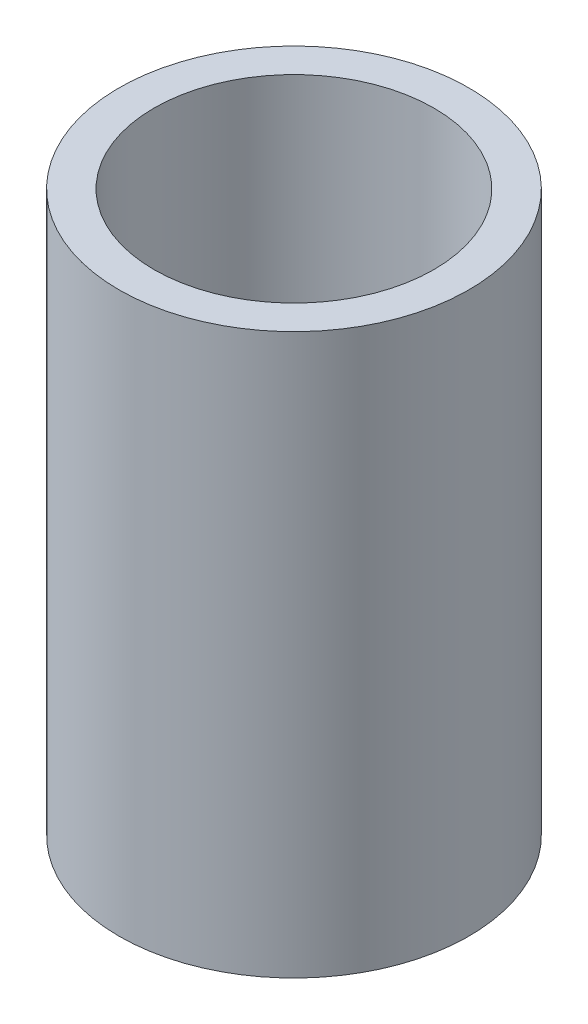
ISO-10303-21;
HEADER;
FILE_DESCRIPTION(('STEP AP214'),'2;1');
FILE_NAME('part.step','',(''),(''),'','','');
FILE_SCHEMA(('AUTOMOTIVE_DESIGN { 1 0 10303 214 1 1 1 1 }'));
ENDSEC;
DATA;
#1=APPLICATION_CONTEXT('core data for automotive mechanical design processes');
#2=APPLICATION_PROTOCOL_DEFINITION('international standard','automotive_design',2000,#1);
#3=PRODUCT_CONTEXT('',#1,'mechanical');
#4=PRODUCT('Part','Part','',(#3));
#5=PRODUCT_RELATED_PRODUCT_CATEGORY('part','',(#4));
#6=PRODUCT_DEFINITION_FORMATION('','',#4);
#7=PRODUCT_DEFINITION_CONTEXT('part definition',#1,'design');
#8=PRODUCT_DEFINITION('design','',#6,#7);
#9=PRODUCT_DEFINITION_SHAPE('','',#8);
#10=(LENGTH_UNIT() NAMED_UNIT(*) SI_UNIT(.MILLI.,.METRE.));
#11=(NAMED_UNIT(*) PLANE_ANGLE_UNIT() SI_UNIT($,.RADIAN.));
#12=(NAMED_UNIT(*) SI_UNIT($,.STERADIAN.) SOLID_ANGLE_UNIT());
#13=UNCERTAINTY_MEASURE_WITH_UNIT(LENGTH_MEASURE(1.E-05),#10,'distance_accuracy_value','');
#14=(GEOMETRIC_REPRESENTATION_CONTEXT(3) GLOBAL_UNCERTAINTY_ASSIGNED_CONTEXT((#13)) GLOBAL_UNIT_ASSIGNED_CONTEXT((#10,
#11,#12)) REPRESENTATION_CONTEXT('',''));
#15=CARTESIAN_POINT('',(0.,0.,0.));
#16=DIRECTION('',(0.,0.,1.));
#17=DIRECTION('',(1.,0.,0.));
#18=AXIS2_PLACEMENT_3D('',#15,#16,#17);
#19=CARTESIAN_POINT('',(0.,24.,0.));
#20=DIRECTION('',(0.,1.,0.));
#21=DIRECTION('',(0.,0.,1.));
#22=AXIS2_PLACEMENT_3D('',#19,#20,#21);
#23=PLANE('',#22);
#24=CARTESIAN_POINT('',(0.,24.,0.));
#25=DIRECTION('',(0.,1.,0.));
#26=DIRECTION('',(0.,0.,1.));
#27=AXIS2_PLACEMENT_3D('',#24,#25,#26);
#28=CIRCLE('',#27,7.5);
#29=CARTESIAN_POINT('',(0.,24.,7.5));
#30=VERTEX_POINT('',#29);
#31=EDGE_CURVE('E10',#30,#30,#28,.T.);
#32=ORIENTED_EDGE('',*,*,#31,.T.);
#33=EDGE_LOOP('',(#32));
#34=FACE_BOUND('',#33,.T.);
#35=CARTESIAN_POINT('',(0.,24.,0.));
#36=DIRECTION('',(0.,1.,0.));
#37=DIRECTION('',(0.,0.,1.));
#38=AXIS2_PLACEMENT_3D('',#35,#36,#37);
#39=CIRCLE('',#38,6.);
#40=CARTESIAN_POINT('',(0.,24.,6.));
#41=VERTEX_POINT('',#40);
#42=EDGE_CURVE('E41',#41,#41,#39,.T.);
#43=ORIENTED_EDGE('',*,*,#42,.F.);
#44=EDGE_LOOP('',(#43));
#45=FACE_BOUND('',#44,.T.);
#46=ADVANCED_FACE('F30',(#34,#45),#23,.T.);
#47=CARTESIAN_POINT('',(0.,0.,0.));
#48=DIRECTION('',(0.,1.,0.));
#49=DIRECTION('',(0.,0.,1.));
#50=AXIS2_PLACEMENT_3D('',#47,#48,#49);
#51=PLANE('',#50);
#52=CARTESIAN_POINT('',(0.,0.,0.));
#53=DIRECTION('',(0.,1.,0.));
#54=DIRECTION('',(0.,0.,1.));
#55=AXIS2_PLACEMENT_3D('',#52,#53,#54);
#56=CIRCLE('',#55,7.5);
#57=CARTESIAN_POINT('',(0.,0.,7.5));
#58=VERTEX_POINT('',#57);
#59=EDGE_CURVE('E34',#58,#58,#56,.T.);
#60=ORIENTED_EDGE('',*,*,#59,.F.);
#61=EDGE_LOOP('',(#60));
#62=FACE_BOUND('',#61,.T.);
#63=CARTESIAN_POINT('',(0.,0.,0.));
#64=DIRECTION('',(0.,1.,0.));
#65=DIRECTION('',(0.,0.,1.));
#66=AXIS2_PLACEMENT_3D('',#63,#64,#65);
#67=CIRCLE('',#66,6.);
#68=CARTESIAN_POINT('',(0.,0.,6.));
#69=VERTEX_POINT('',#68);
#70=EDGE_CURVE('E43',#69,#69,#67,.T.);
#71=ORIENTED_EDGE('',*,*,#70,.T.);
#72=EDGE_LOOP('',(#71));
#73=FACE_BOUND('',#72,.T.);
#74=ADVANCED_FACE('F53',(#62,#73),#51,.F.);
#75=CARTESIAN_POINT('',(0.,24.,0.));
#76=DIRECTION('',(0.,-1.,0.));
#77=DIRECTION('',(0.,0.,-1.));
#78=AXIS2_PLACEMENT_3D('',#75,#76,#77);
#79=CYLINDRICAL_SURFACE('',#78,7.5);
#80=ORIENTED_EDGE('',*,*,#31,.F.);
#81=EDGE_LOOP('',(#80));
#82=FACE_BOUND('',#81,.T.);
#83=ORIENTED_EDGE('',*,*,#59,.T.);
#84=EDGE_LOOP('',(#83));
#85=FACE_BOUND('',#84,.T.);
#86=ADVANCED_FACE('F32',(#82,#85),#79,.T.);
#87=CARTESIAN_POINT('',(0.,24.,0.));
#88=DIRECTION('',(0.,-1.,0.));
#89=DIRECTION('',(0.,0.,-1.));
#90=AXIS2_PLACEMENT_3D('',#87,#88,#89);
#91=CYLINDRICAL_SURFACE('',#90,6.);
#92=ORIENTED_EDGE('',*,*,#42,.T.);
#93=EDGE_LOOP('',(#92));
#94=FACE_BOUND('',#93,.T.);
#95=ORIENTED_EDGE('',*,*,#70,.F.);
#96=EDGE_LOOP('',(#95));
#97=FACE_BOUND('',#96,.T.);
#98=ADVANCED_FACE('F49',(#94,#97),#91,.F.);
#99=CLOSED_SHELL('',(#46,#74,#86,#98));
#100=MANIFOLD_SOLID_BREP('B2',#99);
#101=ADVANCED_BREP_SHAPE_REPRESENTATION('',(#18,#100),#14);
#102=SHAPE_DEFINITION_REPRESENTATION(#9,#101);
ENDSEC;
END-ISO-10303-21;
